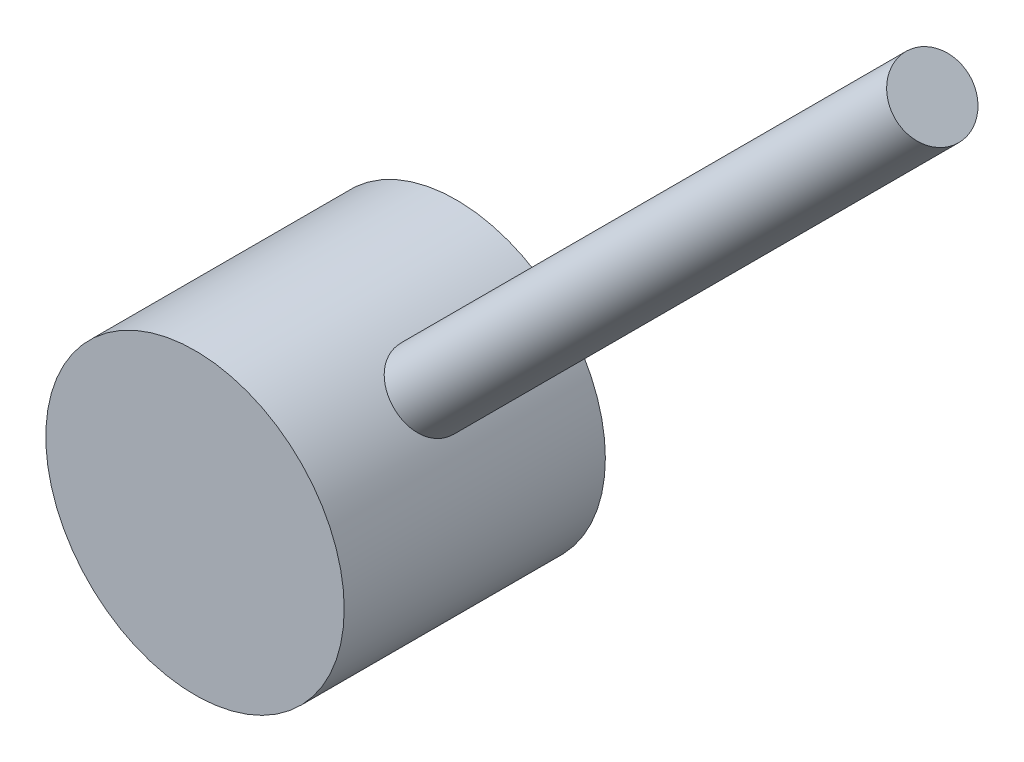
ISO-10303-21;
HEADER;
FILE_DESCRIPTION(('STEP AP214'),'2;1');
FILE_NAME('part.step','',(''),(''),'','','');
FILE_SCHEMA(('AUTOMOTIVE_DESIGN { 1 0 10303 214 1 1 1 1 }'));
ENDSEC;
DATA;
#1=APPLICATION_CONTEXT('core data for automotive mechanical design processes');
#2=APPLICATION_PROTOCOL_DEFINITION('international standard','automotive_design',2000,#1);
#3=PRODUCT_CONTEXT('',#1,'mechanical');
#4=PRODUCT('Part','Part','',(#3));
#5=PRODUCT_RELATED_PRODUCT_CATEGORY('part','',(#4));
#6=PRODUCT_DEFINITION_FORMATION('','',#4);
#7=PRODUCT_DEFINITION_CONTEXT('part definition',#1,'design');
#8=PRODUCT_DEFINITION('design','',#6,#7);
#9=PRODUCT_DEFINITION_SHAPE('','',#8);
#10=(LENGTH_UNIT() NAMED_UNIT(*) SI_UNIT(.MILLI.,.METRE.));
#11=(NAMED_UNIT(*) PLANE_ANGLE_UNIT() SI_UNIT($,.RADIAN.));
#12=(NAMED_UNIT(*) SI_UNIT($,.STERADIAN.) SOLID_ANGLE_UNIT());
#13=UNCERTAINTY_MEASURE_WITH_UNIT(LENGTH_MEASURE(1.E-05),#10,'distance_accuracy_value','');
#14=(GEOMETRIC_REPRESENTATION_CONTEXT(3) GLOBAL_UNCERTAINTY_ASSIGNED_CONTEXT((#13)) GLOBAL_UNIT_ASSIGNED_CONTEXT((#10,
#11,#12)) REPRESENTATION_CONTEXT('',''));
#15=CARTESIAN_POINT('',(0.,0.,0.));
#16=DIRECTION('',(0.,0.,1.));
#17=DIRECTION('',(1.,0.,0.));
#18=AXIS2_PLACEMENT_3D('',#15,#16,#17);
#19=CARTESIAN_POINT('',(0.,0.,-2.5));
#20=DIRECTION('',(0.,0.,1.));
#21=DIRECTION('',(1.,0.,0.));
#22=AXIS2_PLACEMENT_3D('',#19,#20,#21);
#23=CYLINDRICAL_SURFACE('',#22,4.);
#24=CARTESIAN_POINT('',(0.,0.,4.5));
#25=DIRECTION('',(0.,0.,1.));
#26=DIRECTION('',(1.,0.,0.));
#27=AXIS2_PLACEMENT_3D('',#24,#25,#26);
#28=CIRCLE('',#27,4.);
#29=CARTESIAN_POINT('',(4.,0.,4.5));
#30=VERTEX_POINT('',#29);
#31=EDGE_CURVE('E44',#30,#30,#28,.T.);
#32=ORIENTED_EDGE('',*,*,#31,.F.);
#33=EDGE_LOOP('',(#32));
#34=FACE_BOUND('',#33,.T.);
#35=CARTESIAN_POINT('',(0.,0.,-2.5));
#36=DIRECTION('',(0.,0.,1.));
#37=DIRECTION('',(1.,0.,0.));
#38=AXIS2_PLACEMENT_3D('',#35,#36,#37);
#39=CIRCLE('',#38,4.);
#40=CARTESIAN_POINT('',(4.,0.,-2.5));
#41=VERTEX_POINT('',#40);
#42=EDGE_CURVE('E10',#41,#41,#39,.T.);
#43=ORIENTED_EDGE('',*,*,#42,.T.);
#44=EDGE_LOOP('',(#43));
#45=FACE_BOUND('',#44,.T.);
#46=CARTESIAN_POINT('',(3.44571956871238,2.03150600633928,1.));
#47=CARTESIAN_POINT('',(3.44571920512029,2.03150786102785,1.05522030035679));
#48=CARTESIAN_POINT('',(3.44331850065809,2.03559547396367,1.11045795943136));
#49=CARTESIAN_POINT('',(3.43372233750071,2.05173976259927,1.21934703123261));
#50=CARTESIAN_POINT('',(3.42652408827732,2.06380107622934,1.27299750177996));
#51=CARTESIAN_POINT('',(3.40737177622151,2.09526941129613,1.37712141528784));
#52=CARTESIAN_POINT('',(3.39542385223409,2.11466694926496,1.42759886215776));
#53=CARTESIAN_POINT('',(3.3668190939273,2.15991728049345,1.52412434101248));
#54=CARTESIAN_POINT('',(3.35016205968684,2.18577034781144,1.57017218483115));
#55=CARTESIAN_POINT('',(3.31183801438653,2.24342318507772,1.65754465810584));
#56=CARTESIAN_POINT('',(3.29007815323238,2.27533077112197,1.69875744014027));
#57=CARTESIAN_POINT('',(3.24188966199224,2.3434782161646,1.77430455774388));
#58=CARTESIAN_POINT('',(3.21546059585828,2.37971847968101,1.80863825024863));
#59=CARTESIAN_POINT('',(3.15781142348737,2.45571367299132,1.86991018705258));
#60=CARTESIAN_POINT('',(3.12652961173735,2.49551058837384,1.8967385552646));
#61=CARTESIAN_POINT('',(3.05995405259716,2.576709820172,1.94152385766121));
#62=CARTESIAN_POINT('',(3.02466089808703,2.61811189874863,1.9594821007662));
#63=CARTESIAN_POINT('',(2.95157863702701,2.70021136375124,1.98565913383144));
#64=CARTESIAN_POINT('',(2.91385457814587,2.74090603476691,1.99406785773063));
#65=CARTESIAN_POINT('',(2.83628018487078,2.82110351284523,2.00150335171022));
#66=CARTESIAN_POINT('',(2.79643016570666,2.8606064952549,2.00053150888384));
#67=CARTESIAN_POINT('',(2.7167043471106,2.93640560200691,1.98937005989994));
#68=CARTESIAN_POINT('',(2.67684874087194,2.97275343471458,1.97938546997846));
#69=CARTESIAN_POINT('',(2.59750379746155,3.04232805283904,1.9508114919806));
#70=CARTESIAN_POINT('',(2.55801447990141,3.07555467200131,1.93222164584904));
#71=CARTESIAN_POINT('',(2.48034909905381,3.13853357116541,1.88679897172517));
#72=CARTESIAN_POINT('',(2.44218812554603,3.16825174624132,1.8598931821353));
#73=CARTESIAN_POINT('',(2.36886710892276,3.22344188944812,1.7986577283535));
#74=CARTESIAN_POINT('',(2.33370758938724,3.24891311746826,1.76432677257575));
#75=CARTESIAN_POINT('',(2.2667586461368,3.29598655689693,1.68811650320705));
#76=CARTESIAN_POINT('',(2.23508618721235,3.31746539702688,1.64605804306089));
#77=CARTESIAN_POINT('',(2.17752387619331,3.35553036421659,1.5561600105839));
#78=CARTESIAN_POINT('',(2.15163429437902,3.37211626260149,1.5083201682036));
#79=CARTESIAN_POINT('',(2.10667889035419,3.40038466911585,1.40788398634042));
#80=CARTESIAN_POINT('',(2.08764676459347,3.41204301122404,1.35526570787472));
#81=CARTESIAN_POINT('',(2.05753149124152,3.43028826074597,1.24696581276942));
#82=CARTESIAN_POINT('',(2.04644664263547,3.43687625342649,1.19128485440675));
#83=CARTESIAN_POINT('',(2.03299533053976,3.44484978028896,1.08001619939075));
#84=CARTESIAN_POINT('',(2.03040632843911,3.44636812686471,1.02446488266815));
#85=CARTESIAN_POINT('',(2.03345707765124,3.44456898147411,0.913671225368738));
#86=CARTESIAN_POINT('',(2.03909607147776,3.44125193466407,0.858428856819505));
#87=CARTESIAN_POINT('',(2.05814611009599,3.42989110163379,0.750754294018119));
#88=CARTESIAN_POINT('',(2.0714284826325,3.421925540107,0.698290909371664));
#89=CARTESIAN_POINT('',(2.10502552062942,3.40136046898061,0.596627416859328));
#90=CARTESIAN_POINT('',(2.12534101912147,3.38876041044156,0.547427696377866));
#91=CARTESIAN_POINT('',(2.17256881347024,3.35868141978302,0.452623488853062));
#92=CARTESIAN_POINT('',(2.19960270192322,3.34111162675603,0.40710846398276));
#93=CARTESIAN_POINT('',(2.25892900785915,3.30128967041374,0.321924654879459));
#94=CARTESIAN_POINT('',(2.2912222894194,3.27903673751923,0.282256833339971));
#95=CARTESIAN_POINT('',(2.36069500389994,3.22939367477673,0.208875582971618));
#96=CARTESIAN_POINT('',(2.39797647678129,3.20188893760893,0.175335974980476));
#97=CARTESIAN_POINT('',(2.47535893934294,3.14244727061752,0.116425653219503));
#98=CARTESIAN_POINT('',(2.51545978182307,3.11051057210333,0.0910545133567178));
#99=CARTESIAN_POINT('',(2.59672397361251,3.04299066221868,0.0494215861888278));
#100=CARTESIAN_POINT('',(2.63787736047576,3.0074359448092,0.0330942862483758));
#101=CARTESIAN_POINT('',(2.7200922941294,2.93328464969675,0.00981586615663338));
#102=CARTESIAN_POINT('',(2.76115385711612,2.89468866056234,0.00286293650437952));
#103=CARTESIAN_POINT('',(2.84074861634765,2.81658886155833,-0.00136758957553435));
#104=CARTESIAN_POINT('',(2.87932015652093,2.7771378144922,0.00109829090460927));
#105=CARTESIAN_POINT('',(2.95402799982966,2.69753562662628,0.0150478272943311));
#106=CARTESIAN_POINT('',(2.99016437535494,2.65738450668216,0.0265312150131022));
#107=CARTESIAN_POINT('',(3.05896187059983,2.57788737846442,0.0580522197709264));
#108=CARTESIAN_POINT('',(3.09164065169263,2.53853819957819,0.0780434533146229));
#109=CARTESIAN_POINT('',(3.15315173098224,2.46171860369551,0.125970579019326));
#110=CARTESIAN_POINT('',(3.18198354362489,2.42424842423321,0.153907472669568));
#111=CARTESIAN_POINT('',(3.23605610001212,2.35160421090075,0.21771523399707));
#112=CARTESIAN_POINT('',(3.26119426405297,2.31650669200102,0.253760142907367));
#113=CARTESIAN_POINT('',(3.30680007265379,2.25092698511471,0.332422851973807));
#114=CARTESIAN_POINT('',(3.32726653158134,2.22044596940983,0.375042316097943));
#115=CARTESIAN_POINT('',(3.36373296908821,2.16481641357636,0.466601414201293));
#116=CARTESIAN_POINT('',(3.37964249807525,2.13977796449598,0.515644123412481));
#117=CARTESIAN_POINT('',(3.40639248575232,2.09693411079246,0.618055489922846));
#118=CARTESIAN_POINT('',(3.41723663298652,2.07912344423753,0.671420966107285));
#119=CARTESIAN_POINT('',(3.43225503214215,2.05421347676282,0.770577011826274));
#120=CARTESIAN_POINT('',(3.437302490931,2.04572600379187,0.815893164382357));
#121=CARTESIAN_POINT('',(3.44403476813175,2.03437173124192,0.907468869001465));
#122=CARTESIAN_POINT('',(3.44571987338311,2.0315044522094,0.953728340250628));
#123=CARTESIAN_POINT('',(3.44571956871238,2.03150600633928,1.));
#124=B_SPLINE_CURVE_WITH_KNOTS('',3,(#46,#47,#48,#49,#50,#51,#52,#53,#54,#55,#56,#57,#58,#59,
#60,#61,#62,#63,#64,#65,#66,#67,#68,#69,#70,#71,#72,#73,#74,#75,#76,#77,#78,#79,#80,#81,#82,#83,
#84,#85,#86,#87,#88,#89,#90,#91,#92,#93,#94,#95,#96,#97,#98,#99,#100,#101,#102,#103,#104,#105,
#106,#107,#108,#109,#110,#111,#112,#113,#114,#115,#116,#117,#118,#119,#120,#121,#122,#123),
.UNSPECIFIED.,.T.,.F.,(4,2,2,2,2,2,2,2,2,2,2,2,2,2,2,2,2,2,2,2,2,2,2,2,2,2,2,2,2,2,2,2,2,2,2,2,
2,2,4),(0.,0.16549097667523,0.33107829653421,0.496452290829152,0.661833306984657,
0.830495816734648,0.99917408588221,1.17020598555442,1.34121263935111,1.50875500394413,
1.67627259462682,1.84007305071853,2.00388222686189,2.16917149698052,2.3344895418384,
2.50428186625039,2.67408212476195,2.84470572799635,3.01529280048093,3.18137429900961,
3.34744050869795,3.51078961999957,3.67415808564841,3.84073138339937,4.00733207550292,
4.17810132382402,4.34886166284096,4.51836829119046,4.6878421955989,4.85273378447257,
5.01762046947067,5.18161950620159,5.34563922291503,5.51358838629103,5.68158012622478,
5.85270590910145,6.02370688542922,6.16239130867206,6.30106390036083),.UNSPECIFIED.);
#125=CARTESIAN_POINT('',(3.44571956871238,2.03150600633928,1.));
#126=VERTEX_POINT('',#125);
#127=EDGE_CURVE('E36',#126,#126,#124,.T.);
#128=ORIENTED_EDGE('',*,*,#127,.T.);
#129=EDGE_LOOP('',(#128));
#130=FACE_BOUND('',#129,.T.);
#131=ADVANCED_FACE('F32',(#34,#45,#130),#23,.T.);
#132=CARTESIAN_POINT('',(0.,0.,-2.5));
#133=DIRECTION('',(0.,0.,1.));
#134=DIRECTION('',(1.,0.,0.));
#135=AXIS2_PLACEMENT_3D('',#132,#133,#134);
#136=PLANE('',#135);
#137=ORIENTED_EDGE('',*,*,#42,.F.);
#138=EDGE_LOOP('',(#137));
#139=FACE_BOUND('',#138,.T.);
#140=ADVANCED_FACE('F68',(#139),#136,.F.);
#141=CARTESIAN_POINT('',(0.,0.,4.5));
#142=DIRECTION('',(0.,0.,1.));
#143=DIRECTION('',(1.,0.,0.));
#144=AXIS2_PLACEMENT_3D('',#141,#142,#143);
#145=PLANE('',#144);
#146=ORIENTED_EDGE('',*,*,#31,.T.);
#147=EDGE_LOOP('',(#146));
#148=FACE_BOUND('',#147,.T.);
#149=ADVANCED_FACE('F62',(#148),#145,.T.);
#150=CARTESIAN_POINT('',(16.2634559672906,16.2634559672906,1.));
#151=DIRECTION('',(-0.707106781186549,-0.707106781186546,0.));
#152=DIRECTION('',(0.707106781186546,-0.707106781186549,0.));
#153=AXIS2_PLACEMENT_3D('',#150,#151,#152);
#154=CYLINDRICAL_SURFACE('',#153,1.);
#155=ORIENTED_EDGE('',*,*,#127,.F.);
#156=EDGE_LOOP('',(#155));
#157=FACE_BOUND('',#156,.T.);
#158=CARTESIAN_POINT('',(16.2634559672906,16.2634559672906,1.));
#159=DIRECTION('',(0.707106781186549,0.707106781186546,0.));
#160=DIRECTION('',(-0.707106781186546,0.707106781186549,0.));
#161=AXIS2_PLACEMENT_3D('',#158,#159,#160);
#162=CIRCLE('',#161,1.);
#163=CARTESIAN_POINT('',(15.5563491861041,16.9705627484771,1.));
#164=VERTEX_POINT('',#163);
#165=EDGE_CURVE('E50',#164,#164,#162,.T.);
#166=ORIENTED_EDGE('',*,*,#165,.F.);
#167=EDGE_LOOP('',(#166));
#168=FACE_BOUND('',#167,.T.);
#169=ADVANCED_FACE('F58',(#157,#168),#154,.T.);
#170=CARTESIAN_POINT('',(16.2634559672906,16.2634559672906,1.));
#171=DIRECTION('',(0.707106781186549,0.707106781186546,0.));
#172=DIRECTION('',(-0.707106781186546,0.707106781186549,0.));
#173=AXIS2_PLACEMENT_3D('',#170,#171,#172);
#174=PLANE('',#173);
#175=ORIENTED_EDGE('',*,*,#165,.T.);
#176=EDGE_LOOP('',(#175));
#177=FACE_BOUND('',#176,.T.);
#178=ADVANCED_FACE('F61',(#177),#174,.T.);
#179=CLOSED_SHELL('',(#131,#140,#149,#169,#178));
#180=MANIFOLD_SOLID_BREP('B2',#179);
#181=ADVANCED_BREP_SHAPE_REPRESENTATION('',(#18,#180),#14);
#182=SHAPE_DEFINITION_REPRESENTATION(#9,#181);
ENDSEC;
END-ISO-10303-21;
